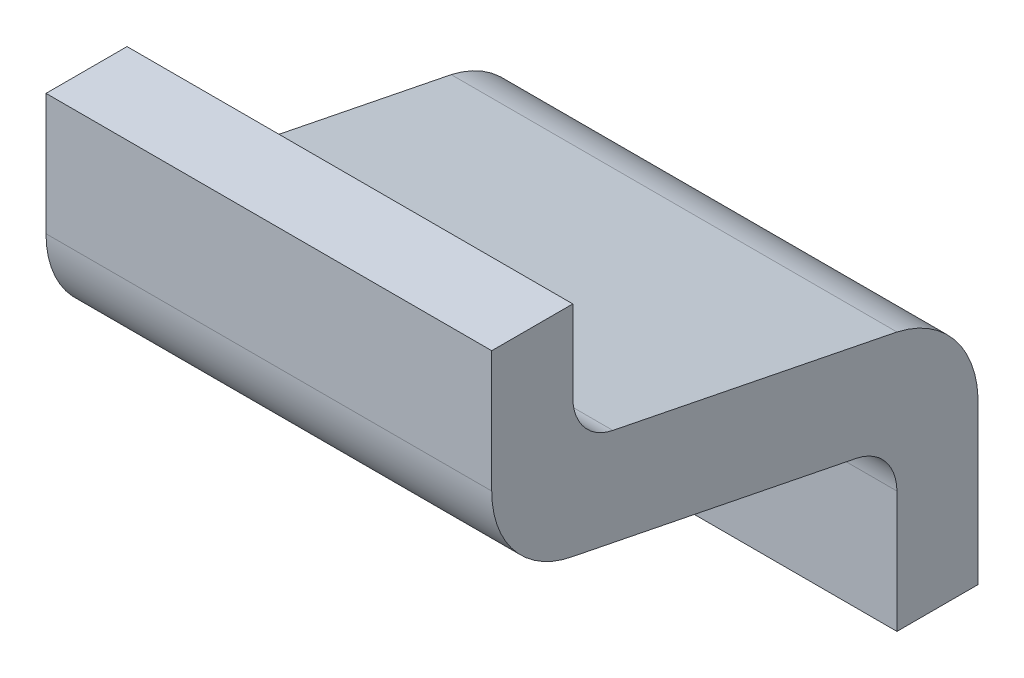
ISO-10303-21;
HEADER;
FILE_DESCRIPTION(('STEP AP214'),'2;1');
FILE_NAME('part.step','',(''),(''),'','','');
FILE_SCHEMA(('AUTOMOTIVE_DESIGN { 1 0 10303 214 1 1 1 1 }'));
ENDSEC;
DATA;
#1=APPLICATION_CONTEXT('core data for automotive mechanical design processes');
#2=APPLICATION_PROTOCOL_DEFINITION('international standard','automotive_design',2000,#1);
#3=PRODUCT_CONTEXT('',#1,'mechanical');
#4=PRODUCT('Part','Part','',(#3));
#5=PRODUCT_RELATED_PRODUCT_CATEGORY('part','',(#4));
#6=PRODUCT_DEFINITION_FORMATION('','',#4);
#7=PRODUCT_DEFINITION_CONTEXT('part definition',#1,'design');
#8=PRODUCT_DEFINITION('design','',#6,#7);
#9=PRODUCT_DEFINITION_SHAPE('','',#8);
#10=(LENGTH_UNIT() NAMED_UNIT(*) SI_UNIT(.MILLI.,.METRE.));
#11=(NAMED_UNIT(*) PLANE_ANGLE_UNIT() SI_UNIT($,.RADIAN.));
#12=(NAMED_UNIT(*) SI_UNIT($,.STERADIAN.) SOLID_ANGLE_UNIT());
#13=UNCERTAINTY_MEASURE_WITH_UNIT(LENGTH_MEASURE(1.E-05),#10,'distance_accuracy_value','');
#14=(GEOMETRIC_REPRESENTATION_CONTEXT(3) GLOBAL_UNCERTAINTY_ASSIGNED_CONTEXT((#13)) GLOBAL_UNIT_ASSIGNED_CONTEXT((#10,
#11,#12)) REPRESENTATION_CONTEXT('',''));
#15=CARTESIAN_POINT('',(0.,0.,0.));
#16=DIRECTION('',(0.,0.,1.));
#17=DIRECTION('',(1.,0.,0.));
#18=AXIS2_PLACEMENT_3D('',#15,#16,#17);
#19=CARTESIAN_POINT('',(-1.15,-1.2,0.));
#20=DIRECTION('',(0.,-1.,0.));
#21=DIRECTION('',(1.,0.,0.));
#22=AXIS2_PLACEMENT_3D('',#19,#20,#21);
#23=PLANE('',#22);
#24=DIRECTION('',(1.,0.,0.));
#25=VECTOR('',#24,1.);
#26=CARTESIAN_POINT('',(-0.95,-1.2,0.));
#27=LINE('',#26,#25);
#28=CARTESIAN_POINT('',(-1.15,-1.2,0.));
#29=VERTEX_POINT('',#28);
#30=CARTESIAN_POINT('',(-0.6,-1.2,0.));
#31=VERTEX_POINT('',#30);
#32=EDGE_CURVE('E126',#29,#31,#27,.T.);
#33=ORIENTED_EDGE('',*,*,#32,.T.);
#34=DIRECTION('',(0.,0.,1.));
#35=VECTOR('',#34,1.);
#36=CARTESIAN_POINT('',(-0.6,-1.2,0.));
#37=LINE('',#36,#35);
#38=CARTESIAN_POINT('',(-0.6,-1.2,0.1));
#39=VERTEX_POINT('',#38);
#40=EDGE_CURVE('E159',#39,#31,#37,.F.);
#41=ORIENTED_EDGE('',*,*,#40,.F.);
#42=DIRECTION('',(-1.,0.,0.));
#43=VECTOR('',#42,1.);
#44=CARTESIAN_POINT('',(-0.75,-1.2,0.1));
#45=LINE('',#44,#43);
#46=CARTESIAN_POINT('',(-1.15,-1.2,0.1));
#47=VERTEX_POINT('',#46);
#48=EDGE_CURVE('E201',#39,#47,#45,.T.);
#49=ORIENTED_EDGE('',*,*,#48,.T.);
#50=DIRECTION('',(0.,0.,1.));
#51=VECTOR('',#50,1.);
#52=CARTESIAN_POINT('',(-1.15,-1.2,0.));
#53=LINE('',#52,#51);
#54=EDGE_CURVE('E129',#29,#47,#53,.T.);
#55=ORIENTED_EDGE('',*,*,#54,.F.);
#56=EDGE_LOOP('',(#33,#41,#49,#55));
#57=FACE_BOUND('',#56,.T.);
#58=ADVANCED_FACE('F17',(#57),#23,.T.);
#59=CARTESIAN_POINT('',(-0.75,-1.05,0.1));
#60=DIRECTION('',(0.,0.,-1.));
#61=DIRECTION('',(-1.,0.,0.));
#62=AXIS2_PLACEMENT_3D('',#59,#60,#61);
#63=PLANE('',#62);
#64=DIRECTION('',(0.,-1.,0.));
#65=VECTOR('',#64,1.);
#66=CARTESIAN_POINT('',(-1.15,-0.7,0.1));
#67=LINE('',#66,#65);
#68=CARTESIAN_POINT('',(-1.15,-1.05,0.099999999999953));
#69=VERTEX_POINT('',#68);
#70=EDGE_CURVE('E148',#47,#69,#67,.F.);
#71=ORIENTED_EDGE('',*,*,#70,.F.);
#72=ORIENTED_EDGE('',*,*,#48,.F.);
#73=DIRECTION('',(0.,1.,0.));
#74=VECTOR('',#73,1.);
#75=CARTESIAN_POINT('',(-0.6,-1.2,0.1));
#76=LINE('',#75,#74);
#77=CARTESIAN_POINT('',(-0.6,-1.05,0.0999999999999295));
#78=VERTEX_POINT('',#77);
#79=EDGE_CURVE('E153',#78,#39,#76,.F.);
#80=ORIENTED_EDGE('',*,*,#79,.F.);
#81=DIRECTION('',(-1.,0.,0.));
#82=VECTOR('',#81,1.);
#83=CARTESIAN_POINT('',(-0.75,-1.05,0.099999999999906));
#84=LINE('',#83,#82);
#85=EDGE_CURVE('E198',#78,#69,#84,.T.);
#86=ORIENTED_EDGE('',*,*,#85,.T.);
#87=EDGE_LOOP('',(#71,#72,#80,#86));
#88=FACE_BOUND('',#87,.T.);
#89=ADVANCED_FACE('F367',(#88),#63,.F.);
#90=CARTESIAN_POINT('',(-0.75,-1.050999994712,0.162200018196));
#91=DIRECTION('',(-1.,0.,0.));
#92=DIRECTION('',(0.,-1.,0.));
#93=AXIS2_PLACEMENT_3D('',#90,#91,#92);
#94=CYLINDRICAL_SURFACE('',#93,0.06220805617457);
#95=CARTESIAN_POINT('',(-1.15,-1.050999994712,0.162200018196));
#96=DIRECTION('',(-1.,0.,0.));
#97=DIRECTION('',(0.,-1.,0.));
#98=AXIS2_PLACEMENT_3D('',#95,#96,#97);
#99=CIRCLE('',#98,0.06220805617457);
#100=CARTESIAN_POINT('',(-1.15,-0.989999976430254,0.150000017266841));
#101=VERTEX_POINT('',#100);
#102=EDGE_CURVE('E146',#69,#101,#99,.F.);
#103=ORIENTED_EDGE('',*,*,#102,.F.);
#104=ORIENTED_EDGE('',*,*,#85,.F.);
#105=CARTESIAN_POINT('',(-0.6,-1.050999994712,0.162200018196));
#106=DIRECTION('',(-1.,0.,0.));
#107=DIRECTION('',(0.,-1.,0.));
#108=AXIS2_PLACEMENT_3D('',#105,#106,#107);
#109=CIRCLE('',#108,0.06220805617457);
#110=CARTESIAN_POINT('',(-0.6,-0.989999976430254,0.150000017266841));
#111=VERTEX_POINT('',#110);
#112=EDGE_CURVE('E151',#111,#78,#109,.T.);
#113=ORIENTED_EDGE('',*,*,#112,.F.);
#114=DIRECTION('',(1.,0.,0.));
#115=VECTOR('',#114,1.);
#116=CARTESIAN_POINT('',(-0.75,-0.989999976430426,0.150000017267085));
#117=LINE('',#116,#115);
#118=EDGE_CURVE('E195',#111,#101,#117,.F.);
#119=ORIENTED_EDGE('',*,*,#118,.T.);
#120=EDGE_LOOP('',(#103,#104,#113,#119));
#121=FACE_BOUND('',#120,.T.);
#122=ADVANCED_FACE('F262',(#121),#94,.F.);
#123=CARTESIAN_POINT('',(-0.75,-0.91999999553,0.5));
#124=DIRECTION('',(0.,0.980580684120765,-0.196116092988953));
#125=DIRECTION('',(0.,0.196116092988953,0.980580684120765));
#126=AXIS2_PLACEMENT_3D('',#123,#124,#125);
#127=PLANE('',#126);
#128=DIRECTION('',(0.,0.19611609298776,0.980580684121004));
#129=VECTOR('',#128,1.);
#130=CARTESIAN_POINT('',(-1.15,-0.98999997643,0.150000017267));
#131=LINE('',#130,#129);
#132=CARTESIAN_POINT('',(-1.15,-0.919999995529999,0.500000000000003));
#133=VERTEX_POINT('',#132);
#134=EDGE_CURVE('E145',#101,#133,#131,.T.);
#135=ORIENTED_EDGE('',*,*,#134,.F.);
#136=ORIENTED_EDGE('',*,*,#118,.F.);
#137=DIRECTION('',(0.,-0.19611609298776,-0.980580684121004));
#138=VECTOR('',#137,1.);
#139=CARTESIAN_POINT('',(-0.6,-0.91999999553,0.5));
#140=LINE('',#139,#138);
#141=CARTESIAN_POINT('',(-0.6,-0.919999995529999,0.500000000000002));
#142=VERTEX_POINT('',#141);
#143=EDGE_CURVE('E154',#142,#111,#140,.T.);
#144=ORIENTED_EDGE('',*,*,#143,.F.);
#145=DIRECTION('',(-1.,0.,0.));
#146=VECTOR('',#145,1.);
#147=CARTESIAN_POINT('',(-0.75,-0.91999999553,0.5));
#148=LINE('',#147,#146);
#149=EDGE_CURVE('E193',#133,#142,#148,.F.);
#150=ORIENTED_EDGE('',*,*,#149,.F.);
#151=EDGE_LOOP('',(#135,#136,#144,#150));
#152=FACE_BOUND('',#151,.T.);
#153=ADVANCED_FACE('F251',(#152),#127,.F.);
#154=CARTESIAN_POINT('',(-0.75,-0.8,0.478000005364));
#155=DIRECTION('',(-1.,0.,0.));
#156=DIRECTION('',(0.,-1.,0.));
#157=AXIS2_PLACEMENT_3D('',#154,#155,#156);
#158=CYLINDRICAL_SURFACE('',#157,0.121999994636);
#159=ORIENTED_EDGE('',*,*,#149,.T.);
#160=CARTESIAN_POINT('',(-0.6,-0.8,0.478000005364));
#161=DIRECTION('',(-1.,0.,0.));
#162=DIRECTION('',(0.,-1.,0.));
#163=AXIS2_PLACEMENT_3D('',#160,#161,#162);
#164=CIRCLE('',#163,0.121999994636);
#165=CARTESIAN_POINT('',(-0.6,-0.8,0.6));
#166=VERTEX_POINT('',#165);
#167=EDGE_CURVE('E20',#166,#142,#164,.F.);
#168=ORIENTED_EDGE('',*,*,#167,.F.);
#169=DIRECTION('',(1.,0.,0.));
#170=VECTOR('',#169,1.);
#171=CARTESIAN_POINT('',(-0.95,-0.8,0.6));
#172=LINE('',#171,#170);
#173=CARTESIAN_POINT('',(-1.15,-0.8,0.6));
#174=VERTEX_POINT('',#173);
#175=EDGE_CURVE('E83',#174,#166,#172,.T.);
#176=ORIENTED_EDGE('',*,*,#175,.F.);
#177=CARTESIAN_POINT('',(-1.15,-0.8,0.478000005364));
#178=DIRECTION('',(-1.,0.,0.));
#179=DIRECTION('',(0.,-1.,0.));
#180=AXIS2_PLACEMENT_3D('',#177,#178,#179);
#181=CIRCLE('',#180,0.121999994636);
#182=EDGE_CURVE('E142',#133,#174,#181,.T.);
#183=ORIENTED_EDGE('',*,*,#182,.F.);
#184=EDGE_LOOP('',(#159,#168,#176,#183));
#185=FACE_BOUND('',#184,.T.);
#186=ADVANCED_FACE('F253',(#185),#158,.T.);
#187=CARTESIAN_POINT('',(-0.95,-0.95,0.6));
#188=DIRECTION('',(0.,0.,1.));
#189=DIRECTION('',(1.,0.,0.));
#190=AXIS2_PLACEMENT_3D('',#187,#188,#189);
#191=PLANE('',#190);
#192=DIRECTION('',(1.,0.,0.));
#193=VECTOR('',#192,1.);
#194=CARTESIAN_POINT('',(-0.75,-0.65,0.6));
#195=LINE('',#194,#193);
#196=CARTESIAN_POINT('',(-1.15,-0.65,0.6));
#197=VERTEX_POINT('',#196);
#198=CARTESIAN_POINT('',(-0.6,-0.65,0.6));
#199=VERTEX_POINT('',#198);
#200=EDGE_CURVE('E93',#197,#199,#195,.T.);
#201=ORIENTED_EDGE('',*,*,#200,.F.);
#202=DIRECTION('',(0.,-1.,0.));
#203=VECTOR('',#202,1.);
#204=CARTESIAN_POINT('',(-1.15,-0.7,0.6));
#205=LINE('',#204,#203);
#206=EDGE_CURVE('E144',#174,#197,#205,.F.);
#207=ORIENTED_EDGE('',*,*,#206,.F.);
#208=ORIENTED_EDGE('',*,*,#175,.T.);
#209=DIRECTION('',(0.,1.,0.));
#210=VECTOR('',#209,1.);
#211=CARTESIAN_POINT('',(-0.6,-1.2,0.6));
#212=LINE('',#211,#210);
#213=EDGE_CURVE('E164',#199,#166,#212,.F.);
#214=ORIENTED_EDGE('',*,*,#213,.F.);
#215=EDGE_LOOP('',(#201,#207,#208,#214));
#216=FACE_BOUND('',#215,.T.);
#217=ADVANCED_FACE('F218',(#216),#191,.T.);
#218=CARTESIAN_POINT('',(-0.75,-0.65,0.));
#219=DIRECTION('',(0.,1.,0.));
#220=DIRECTION('',(0.,0.,1.));
#221=AXIS2_PLACEMENT_3D('',#218,#219,#220);
#222=PLANE('',#221);
#223=ORIENTED_EDGE('',*,*,#200,.T.);
#224=DIRECTION('',(0.,0.,1.));
#225=VECTOR('',#224,1.);
#226=CARTESIAN_POINT('',(-0.6,-0.65,0.));
#227=LINE('',#226,#225);
#228=CARTESIAN_POINT('',(-0.6,-0.65,0.5));
#229=VERTEX_POINT('',#228);
#230=EDGE_CURVE('E169',#229,#199,#227,.T.);
#231=ORIENTED_EDGE('',*,*,#230,.F.);
#232=DIRECTION('',(1.,0.,0.));
#233=VECTOR('',#232,1.);
#234=CARTESIAN_POINT('',(-0.75,-0.65,0.5));
#235=LINE('',#234,#233);
#236=CARTESIAN_POINT('',(-1.15,-0.65,0.5));
#237=VERTEX_POINT('',#236);
#238=EDGE_CURVE('E179',#229,#237,#235,.F.);
#239=ORIENTED_EDGE('',*,*,#238,.T.);
#240=DIRECTION('',(0.,0.,1.));
#241=VECTOR('',#240,1.);
#242=CARTESIAN_POINT('',(-1.15,-0.65,0.));
#243=LINE('',#242,#241);
#244=EDGE_CURVE('E184',#197,#237,#243,.F.);
#245=ORIENTED_EDGE('',*,*,#244,.F.);
#246=EDGE_LOOP('',(#223,#231,#239,#245));
#247=FACE_BOUND('',#246,.T.);
#248=ADVANCED_FACE('F219',(#247),#222,.T.);
#249=CARTESIAN_POINT('',(-0.75,-0.749679468147,0.5));
#250=DIRECTION('',(0.,0.,1.));
#251=DIRECTION('',(1.,0.,0.));
#252=AXIS2_PLACEMENT_3D('',#249,#250,#251);
#253=PLANE('',#252);
#254=DIRECTION('',(0.,-1.,0.));
#255=VECTOR('',#254,1.);
#256=CARTESIAN_POINT('',(-1.15,-0.7,0.5));
#257=LINE('',#256,#255);
#258=CARTESIAN_POINT('',(-1.15,-0.749679468147,0.50000000000019));
#259=VERTEX_POINT('',#258);
#260=EDGE_CURVE('E141',#237,#259,#257,.T.);
#261=ORIENTED_EDGE('',*,*,#260,.F.);
#262=ORIENTED_EDGE('',*,*,#238,.F.);
#263=DIRECTION('',(0.,1.,0.));
#264=VECTOR('',#263,1.);
#265=CARTESIAN_POINT('',(-0.6,-1.2,0.5));
#266=LINE('',#265,#264);
#267=CARTESIAN_POINT('',(-0.6,-0.749679468147,0.50000000000019));
#268=VERTEX_POINT('',#267);
#269=EDGE_CURVE('E172',#268,#229,#266,.T.);
#270=ORIENTED_EDGE('',*,*,#269,.F.);
#271=DIRECTION('',(-1.,0.,0.));
#272=VECTOR('',#271,1.);
#273=CARTESIAN_POINT('',(-0.75,-0.749679468147,0.50000000000038));
#274=LINE('',#273,#272);
#275=EDGE_CURVE('E130',#268,#259,#274,.T.);
#276=ORIENTED_EDGE('',*,*,#275,.T.);
#277=EDGE_LOOP('',(#261,#262,#270,#276));
#278=FACE_BOUND('',#277,.T.);
#279=ADVANCED_FACE('F283',(#278),#253,.F.);
#280=CARTESIAN_POINT('',(-0.95,-0.95,0.));
#281=DIRECTION('',(0.,0.,1.));
#282=DIRECTION('',(1.,0.,0.));
#283=AXIS2_PLACEMENT_3D('',#280,#281,#282);
#284=PLANE('',#283);
#285=DIRECTION('',(0.,1.,0.));
#286=VECTOR('',#285,1.);
#287=CARTESIAN_POINT('',(-0.6,-1.2,0.));
#288=LINE('',#287,#286);
#289=CARTESIAN_POINT('',(-0.6,-1.00000004750623,3.62638521642089E-13));
#290=VERTEX_POINT('',#289);
#291=EDGE_CURVE('E111',#31,#290,#288,.T.);
#292=ORIENTED_EDGE('',*,*,#291,.F.);
#293=ORIENTED_EDGE('',*,*,#32,.F.);
#294=DIRECTION('',(0.,-1.,0.));
#295=VECTOR('',#294,1.);
#296=CARTESIAN_POINT('',(-1.15,-0.7,0.));
#297=LINE('',#296,#295);
#298=CARTESIAN_POINT('',(-1.15,-1.00000004750623,3.62638521642089E-13));
#299=VERTEX_POINT('',#298);
#300=EDGE_CURVE('E123',#299,#29,#297,.T.);
#301=ORIENTED_EDGE('',*,*,#300,.F.);
#302=DIRECTION('',(-1.,0.,0.));
#303=VECTOR('',#302,1.);
#304=CARTESIAN_POINT('',(-0.75,-1.00000004749703,7.25277043284178E-13));
#305=LINE('',#304,#303);
#306=EDGE_CURVE('E114',#290,#299,#305,.T.);
#307=ORIENTED_EDGE('',*,*,#306,.F.);
#308=EDGE_LOOP('',(#292,#293,#301,#307));
#309=FACE_BOUND('',#308,.T.);
#310=ADVANCED_FACE('F124',(#309),#284,.F.);
#311=CARTESIAN_POINT('',(-0.6,-1.2,0.));
#312=DIRECTION('',(1.,0.,0.));
#313=DIRECTION('',(0.,1.,0.));
#314=AXIS2_PLACEMENT_3D('',#311,#312,#313);
#315=PLANE('',#314);
#316=ORIENTED_EDGE('',*,*,#40,.T.);
#317=ORIENTED_EDGE('',*,*,#291,.T.);
#318=CARTESIAN_POINT('',(-0.6,-1.005049716317,0.128059609711));
#319=DIRECTION('',(-1.,0.,0.));
#320=DIRECTION('',(0.,-1.,0.));
#321=AXIS2_PLACEMENT_3D('',#318,#319,#320);
#322=CIRCLE('',#321,0.128159130749);
#323=CARTESIAN_POINT('',(-0.6,-0.880000041796324,0.100000000008381));
#324=VERTEX_POINT('',#323);
#325=EDGE_CURVE('E117',#324,#290,#322,.T.);
#326=ORIENTED_EDGE('',*,*,#325,.F.);
#327=DIRECTION('',(0.,-0.196116233662029,-0.980580655986146));
#328=VECTOR('',#327,1.);
#329=CARTESIAN_POINT('',(-0.6,-0.880000041798,0.1));
#330=LINE('',#329,#328);
#331=CARTESIAN_POINT('',(-0.6,-0.80988793724747,0.450560339595094));
#332=VERTEX_POINT('',#331);
#333=EDGE_CURVE('E136',#324,#332,#330,.F.);
#334=ORIENTED_EDGE('',*,*,#333,.T.);
#335=CARTESIAN_POINT('',(-0.6,-0.749679468147,0.438618714989));
#336=DIRECTION('',(-1.,0.,0.));
#337=DIRECTION('',(0.,-1.,0.));
#338=AXIS2_PLACEMENT_3D('',#335,#336,#337);
#339=CIRCLE('',#338,0.06138128501138);
#340=EDGE_CURVE('E149',#332,#268,#339,.T.);
#341=ORIENTED_EDGE('',*,*,#340,.T.);
#342=ORIENTED_EDGE('',*,*,#269,.T.);
#343=ORIENTED_EDGE('',*,*,#230,.T.);
#344=ORIENTED_EDGE('',*,*,#213,.T.);
#345=ORIENTED_EDGE('',*,*,#167,.T.);
#346=ORIENTED_EDGE('',*,*,#143,.T.);
#347=ORIENTED_EDGE('',*,*,#112,.T.);
#348=ORIENTED_EDGE('',*,*,#79,.T.);
#349=EDGE_LOOP('',(#316,#317,#326,#334,#341,#342,#343,#344,#345,#346,#347,#348));
#350=FACE_BOUND('',#349,.T.);
#351=ADVANCED_FACE('F216',(#350),#315,.T.);
#352=CARTESIAN_POINT('',(-0.75,-0.749679468147,0.438618714989));
#353=DIRECTION('',(-1.,0.,0.));
#354=DIRECTION('',(0.,-1.,0.));
#355=AXIS2_PLACEMENT_3D('',#352,#353,#354);
#356=CYLINDRICAL_SURFACE('',#355,0.06138128501138);
#357=CARTESIAN_POINT('',(-1.15,-0.749679468147,0.438618714989));
#358=DIRECTION('',(-1.,0.,0.));
#359=DIRECTION('',(0.,-1.,0.));
#360=AXIS2_PLACEMENT_3D('',#357,#358,#359);
#361=CIRCLE('',#360,0.06138128501138);
#362=CARTESIAN_POINT('',(-1.15,-0.80988793724747,0.450560339595094));
#363=VERTEX_POINT('',#362);
#364=EDGE_CURVE('E119',#259,#363,#361,.F.);
#365=ORIENTED_EDGE('',*,*,#364,.F.);
#366=ORIENTED_EDGE('',*,*,#275,.F.);
#367=ORIENTED_EDGE('',*,*,#340,.F.);
#368=DIRECTION('',(1.,0.,0.));
#369=VECTOR('',#368,1.);
#370=CARTESIAN_POINT('',(-0.75,-0.809887937247525,0.450560339595105));
#371=LINE('',#370,#369);
#372=EDGE_CURVE('E230',#332,#363,#371,.F.);
#373=ORIENTED_EDGE('',*,*,#372,.T.);
#374=EDGE_LOOP('',(#365,#366,#367,#373));
#375=FACE_BOUND('',#374,.T.);
#376=ADVANCED_FACE('F275',(#375),#356,.F.);
#377=CARTESIAN_POINT('',(-1.15,-0.7,0.));
#378=DIRECTION('',(-1.,0.,0.));
#379=DIRECTION('',(0.,-1.,0.));
#380=AXIS2_PLACEMENT_3D('',#377,#378,#379);
#381=PLANE('',#380);
#382=ORIENTED_EDGE('',*,*,#364,.T.);
#383=DIRECTION('',(0.,-0.196116233662029,-0.980580655986146));
#384=VECTOR('',#383,1.);
#385=CARTESIAN_POINT('',(-1.15,-0.880000041798,0.1));
#386=LINE('',#385,#384);
#387=CARTESIAN_POINT('',(-1.15,-0.880000041796324,0.100000000008381));
#388=VERTEX_POINT('',#387);
#389=EDGE_CURVE('E26',#363,#388,#386,.T.);
#390=ORIENTED_EDGE('',*,*,#389,.T.);
#391=CARTESIAN_POINT('',(-1.15,-1.005049716317,0.128059609711));
#392=DIRECTION('',(-1.,0.,0.));
#393=DIRECTION('',(0.,-1.,0.));
#394=AXIS2_PLACEMENT_3D('',#391,#392,#393);
#395=CIRCLE('',#394,0.128159130749);
#396=EDGE_CURVE('E34',#299,#388,#395,.F.);
#397=ORIENTED_EDGE('',*,*,#396,.F.);
#398=ORIENTED_EDGE('',*,*,#300,.T.);
#399=ORIENTED_EDGE('',*,*,#54,.T.);
#400=ORIENTED_EDGE('',*,*,#70,.T.);
#401=ORIENTED_EDGE('',*,*,#102,.T.);
#402=ORIENTED_EDGE('',*,*,#134,.T.);
#403=ORIENTED_EDGE('',*,*,#182,.T.);
#404=ORIENTED_EDGE('',*,*,#206,.T.);
#405=ORIENTED_EDGE('',*,*,#244,.T.);
#406=ORIENTED_EDGE('',*,*,#260,.T.);
#407=EDGE_LOOP('',(#382,#390,#397,#398,#399,#400,#401,#402,#403,#404,#405,#406));
#408=FACE_BOUND('',#407,.T.);
#409=ADVANCED_FACE('F133',(#408),#381,.T.);
#410=CARTESIAN_POINT('',(-0.75,-1.005049716317,0.128059609711));
#411=DIRECTION('',(-1.,0.,0.));
#412=DIRECTION('',(0.,-1.,0.));
#413=AXIS2_PLACEMENT_3D('',#410,#411,#412);
#414=CYLINDRICAL_SURFACE('',#413,0.128159130749);
#415=DIRECTION('',(1.,0.,0.));
#416=VECTOR('',#415,1.);
#417=CARTESIAN_POINT('',(-0.75,-0.880000041798,0.1));
#418=LINE('',#417,#416);
#419=EDGE_CURVE('E11',#388,#324,#418,.T.);
#420=ORIENTED_EDGE('',*,*,#419,.T.);
#421=ORIENTED_EDGE('',*,*,#325,.T.);
#422=ORIENTED_EDGE('',*,*,#306,.T.);
#423=ORIENTED_EDGE('',*,*,#396,.T.);
#424=EDGE_LOOP('',(#420,#421,#422,#423));
#425=FACE_BOUND('',#424,.T.);
#426=ADVANCED_FACE('F116',(#425),#414,.T.);
#427=CARTESIAN_POINT('',(-0.75,-0.880000041798,0.1));
#428=DIRECTION('',(0.,-0.980580655986146,0.196116233662029));
#429=DIRECTION('',(0.,-0.196116233662029,-0.980580655986146));
#430=AXIS2_PLACEMENT_3D('',#427,#428,#429);
#431=PLANE('',#430);
#432=ORIENTED_EDGE('',*,*,#389,.F.);
#433=ORIENTED_EDGE('',*,*,#372,.F.);
#434=ORIENTED_EDGE('',*,*,#333,.F.);
#435=ORIENTED_EDGE('',*,*,#419,.F.);
#436=EDGE_LOOP('',(#432,#433,#434,#435));
#437=FACE_BOUND('',#436,.T.);
#438=ADVANCED_FACE('F264',(#437),#431,.F.);
#439=CLOSED_SHELL('',(#58,#89,#122,#153,#186,#217,#248,#279,#310,#351,#376,#409,#426,#438));
#440=MANIFOLD_SOLID_BREP('B1',#439);
#441=ADVANCED_BREP_SHAPE_REPRESENTATION('',(#18,#440),#14);
#442=SHAPE_DEFINITION_REPRESENTATION(#9,#441);
ENDSEC;
END-ISO-10303-21;
